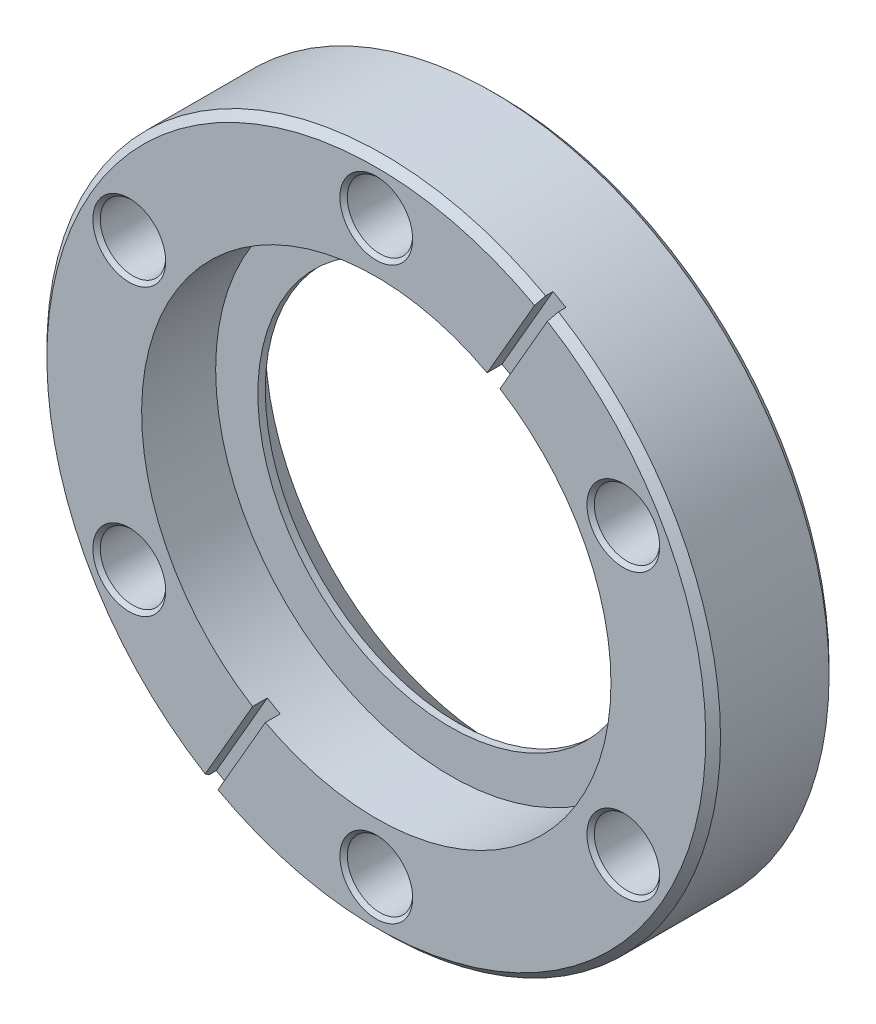
ISO-10303-21;
HEADER;
FILE_DESCRIPTION(('STEP AP214'),'2;1');
FILE_NAME('part.step','',(''),(''),'','','');
FILE_SCHEMA(('AUTOMOTIVE_DESIGN { 1 0 10303 214 1 1 1 1 }'));
ENDSEC;
DATA;
#1=APPLICATION_CONTEXT('core data for automotive mechanical design processes');
#2=APPLICATION_PROTOCOL_DEFINITION('international standard','automotive_design',2000,#1);
#3=PRODUCT_CONTEXT('',#1,'mechanical');
#4=PRODUCT('Part','Part','',(#3));
#5=PRODUCT_RELATED_PRODUCT_CATEGORY('part','',(#4));
#6=PRODUCT_DEFINITION_FORMATION('','',#4);
#7=PRODUCT_DEFINITION_CONTEXT('part definition',#1,'design');
#8=PRODUCT_DEFINITION('design','',#6,#7);
#9=PRODUCT_DEFINITION_SHAPE('','',#8);
#10=(LENGTH_UNIT() NAMED_UNIT(*) SI_UNIT(.MILLI.,.METRE.));
#11=(NAMED_UNIT(*) PLANE_ANGLE_UNIT() SI_UNIT($,.RADIAN.));
#12=(NAMED_UNIT(*) SI_UNIT($,.STERADIAN.) SOLID_ANGLE_UNIT());
#13=UNCERTAINTY_MEASURE_WITH_UNIT(LENGTH_MEASURE(1.E-05),#10,'distance_accuracy_value','');
#14=(GEOMETRIC_REPRESENTATION_CONTEXT(3) GLOBAL_UNCERTAINTY_ASSIGNED_CONTEXT((#13)) GLOBAL_UNIT_ASSIGNED_CONTEXT((#10,
#11,#12)) REPRESENTATION_CONTEXT('',''));
#15=CARTESIAN_POINT('',(0.,0.,0.));
#16=DIRECTION('',(0.,0.,1.));
#17=DIRECTION('',(1.,0.,0.));
#18=AXIS2_PLACEMENT_3D('',#15,#16,#17);
#19=CARTESIAN_POINT('',(-10.8081886423171,-20.2443318662794,-1.524));
#20=DIRECTION('',(0.,0.,1.));
#21=DIRECTION('',(1.,0.,0.));
#22=AXIS2_PLACEMENT_3D('',#19,#20,#21);
#23=PLANE('',#22);
#24=DIRECTION('',(-0.500000000000017,-0.866025403784429,0.));
#25=VECTOR('',#24,1.);
#26=CARTESIAN_POINT('',(0.659911357683662,-0.381,-1.524));
#27=LINE('',#26,#25);
#28=CARTESIAN_POINT('',(-11.411777682795,-21.2897787512802,-1.524));
#29=VERTEX_POINT('',#28);
#30=CARTESIAN_POINT('',(-16.6714013234147,-30.3997141255238,-1.524));
#31=VERTEX_POINT('',#30);
#32=EDGE_CURVE('E111',#29,#31,#27,.T.);
#33=ORIENTED_EDGE('',*,*,#32,.F.);
#34=CARTESIAN_POINT('',(0.,0.,-1.524));
#35=DIRECTION('',(0.,0.,1.));
#36=DIRECTION('',(1.,0.,0.));
#37=AXIS2_PLACEMENT_3D('',#34,#35,#36);
#38=CIRCLE('',#37,24.1554);
#39=CARTESIAN_POINT('',(-12.7316003981625,-20.5277787512802,-1.524));
#40=VERTEX_POINT('',#39);
#41=EDGE_CURVE('E91',#29,#40,#38,.F.);
#42=ORIENTED_EDGE('',*,*,#41,.T.);
#43=DIRECTION('',(-0.500000000000017,-0.866025403784429,0.));
#44=VECTOR('',#43,1.);
#45=CARTESIAN_POINT('',(-0.659911357683662,0.381,-1.524));
#46=LINE('',#45,#44);
#47=CARTESIAN_POINT('',(-17.9912240387821,-29.6377141255239,-1.524));
#48=VERTEX_POINT('',#47);
#49=EDGE_CURVE('E97',#40,#48,#46,.T.);
#50=ORIENTED_EDGE('',*,*,#49,.T.);
#51=CARTESIAN_POINT('',(0.,0.,-1.524));
#52=DIRECTION('',(0.,0.,1.));
#53=DIRECTION('',(1.,0.,0.));
#54=AXIS2_PLACEMENT_3D('',#51,#52,#53);
#55=CIRCLE('',#54,34.671);
#56=EDGE_CURVE('E20',#48,#31,#55,.T.);
#57=ORIENTED_EDGE('',*,*,#56,.T.);
#58=EDGE_LOOP('',(#33,#42,#50,#57));
#59=FACE_BOUND('',#58,.T.);
#60=ADVANCED_FACE('F17',(#59),#23,.T.);
#61=CARTESIAN_POINT('',(12.1280113576829,19.4823318662794,-1.524));
#62=DIRECTION('',(0.,0.,-1.));
#63=DIRECTION('',(-1.,0.,0.));
#64=AXIS2_PLACEMENT_3D('',#61,#62,#63);
#65=PLANE('',#64);
#66=DIRECTION('',(0.500000000000017,0.866025403784429,0.));
#67=VECTOR('',#66,1.);
#68=CARTESIAN_POINT('',(0.659911357683662,-0.381,-1.524));
#69=LINE('',#68,#67);
#70=CARTESIAN_POINT('',(12.7316003981625,20.5277787512802,-1.524));
#71=VERTEX_POINT('',#70);
#72=CARTESIAN_POINT('',(17.9912240387821,29.6377141255239,-1.524));
#73=VERTEX_POINT('',#72);
#74=EDGE_CURVE('E113',#71,#73,#69,.T.);
#75=ORIENTED_EDGE('',*,*,#74,.T.);
#76=CARTESIAN_POINT('',(0.,0.,-1.524));
#77=DIRECTION('',(0.,0.,1.));
#78=DIRECTION('',(1.,0.,0.));
#79=AXIS2_PLACEMENT_3D('',#76,#77,#78);
#80=CIRCLE('',#79,34.671);
#81=CARTESIAN_POINT('',(16.6714013234147,30.3997141255238,-1.524));
#82=VERTEX_POINT('',#81);
#83=EDGE_CURVE('E374',#82,#73,#80,.F.);
#84=ORIENTED_EDGE('',*,*,#83,.F.);
#85=DIRECTION('',(0.500000000000017,0.866025403784429,0.));
#86=VECTOR('',#85,1.);
#87=CARTESIAN_POINT('',(-0.659911357683662,0.381,-1.524));
#88=LINE('',#87,#86);
#89=CARTESIAN_POINT('',(11.411777682795,21.2897787512802,-1.524));
#90=VERTEX_POINT('',#89);
#91=EDGE_CURVE('E102',#90,#82,#88,.T.);
#92=ORIENTED_EDGE('',*,*,#91,.F.);
#93=CARTESIAN_POINT('',(0.,0.,-1.524));
#94=DIRECTION('',(0.,0.,1.));
#95=DIRECTION('',(1.,0.,0.));
#96=AXIS2_PLACEMENT_3D('',#93,#94,#95);
#97=CIRCLE('',#96,24.1554);
#98=EDGE_CURVE('E105',#71,#90,#97,.T.);
#99=ORIENTED_EDGE('',*,*,#98,.F.);
#100=EDGE_LOOP('',(#75,#84,#92,#99));
#101=FACE_BOUND('',#100,.T.);
#102=ADVANCED_FACE('F228',(#101),#65,.F.);
#103=CARTESIAN_POINT('',(-0.659911357683662,0.381,0.));
#104=DIRECTION('',(-0.866025403784429,0.500000000000017,0.));
#105=DIRECTION('',(-0.500000000000017,-0.866025403784429,0.));
#106=AXIS2_PLACEMENT_3D('',#103,#104,#105);
#107=PLANE('',#106);
#108=ORIENTED_EDGE('',*,*,#49,.F.);
#109=DIRECTION('',(0.,0.,1.));
#110=VECTOR('',#109,1.);
#111=CARTESIAN_POINT('',(-12.7316003981627,-20.52777875128,-13.335));
#112=LINE('',#111,#110);
#113=CARTESIAN_POINT('',(-12.731600398163,-20.5277787512798,0.));
#114=VERTEX_POINT('',#113);
#115=EDGE_CURVE('E109',#40,#114,#112,.T.);
#116=ORIENTED_EDGE('',*,*,#115,.T.);
#117=DIRECTION('',(0.499999999999739,0.866025403784589,0.));
#118=VECTOR('',#117,1.);
#119=CARTESIAN_POINT('',(-17.610129918222,-28.9776397462519,0.));
#120=LINE('',#119,#118);
#121=CARTESIAN_POINT('',(-17.6101299182227,-28.9776397462512,-2.81535497978095E-12));
#122=VERTEX_POINT('',#121);
#123=EDGE_CURVE('E189',#122,#114,#120,.T.);
#124=ORIENTED_EDGE('',*,*,#123,.F.);
#125=CARTESIAN_POINT('',(-17.9912240387822,-29.637714125524,-0.761999999999247));
#126=CARTESIAN_POINT('',(-17.9277085263412,-29.5277020309076,-0.634999651275953));
#127=CARTESIAN_POINT('',(-17.8641929267408,-29.4176897853265,-0.507999476914579));
#128=CARTESIAN_POINT('',(-17.7371615532212,-29.1976649922353,-0.253999476915669));
#129=CARTESIAN_POINT('',(-17.673645779302,-29.0876524447252,-0.126999651278132));
#130=CARTESIAN_POINT('',(-17.6101299182234,-28.9776397462504,-2.5153608870471E-12));
#131=B_SPLINE_CURVE_WITH_KNOTS('',3,(#125,#126,#127,#128,#129,#130),.UNSPECIFIED.,.F.,.F.,(4,2,
4),(0.,0.538881924658612,1.07776384931724),.UNSPECIFIED.);
#132=CARTESIAN_POINT('',(-17.9912240387819,-29.6377141255236,-0.761999999999265));
#133=VERTEX_POINT('',#132);
#134=EDGE_CURVE('E101',#133,#122,#131,.T.);
#135=ORIENTED_EDGE('',*,*,#134,.F.);
#136=DIRECTION('',(0.,0.,1.));
#137=VECTOR('',#136,1.);
#138=CARTESIAN_POINT('',(-17.9912240387816,-29.6377141255231,0.));
#139=LINE('',#138,#137);
#140=EDGE_CURVE('E84',#48,#133,#139,.T.);
#141=ORIENTED_EDGE('',*,*,#140,.F.);
#142=EDGE_LOOP('',(#108,#116,#124,#135,#141));
#143=FACE_BOUND('',#142,.T.);
#144=ADVANCED_FACE('F95',(#143),#107,.F.);
#145=CARTESIAN_POINT('',(-0.659911357683662,0.381,0.));
#146=DIRECTION('',(0.866025403784429,-0.500000000000017,0.));
#147=DIRECTION('',(0.500000000000017,0.866025403784429,0.));
#148=AXIS2_PLACEMENT_3D('',#145,#146,#147);
#149=PLANE('',#148);
#150=DIRECTION('',(0.49999999999978,0.866025403784565,0.));
#151=VECTOR('',#150,1.);
#152=CARTESIAN_POINT('',(11.4117776827951,21.2897787512801,0.));
#153=LINE('',#152,#151);
#154=CARTESIAN_POINT('',(11.4117776827951,21.2897787512801,0.));
#155=VERTEX_POINT('',#154);
#156=CARTESIAN_POINT('',(16.2903072028564,29.7396397462523,-1.54719828732884E-12));
#157=VERTEX_POINT('',#156);
#158=EDGE_CURVE('E185',#155,#157,#153,.T.);
#159=ORIENTED_EDGE('',*,*,#158,.F.);
#160=DIRECTION('',(0.,0.,1.));
#161=VECTOR('',#160,1.);
#162=CARTESIAN_POINT('',(11.4117776827951,21.2897787512801,-13.335));
#163=LINE('',#162,#161);
#164=EDGE_CURVE('E196',#155,#90,#163,.F.);
#165=ORIENTED_EDGE('',*,*,#164,.T.);
#166=ORIENTED_EDGE('',*,*,#91,.T.);
#167=DIRECTION('',(0.,0.,1.));
#168=VECTOR('',#167,1.);
#169=CARTESIAN_POINT('',(16.6714013234141,30.3997141255228,0.));
#170=LINE('',#169,#168);
#171=CARTESIAN_POINT('',(16.6714013234151,30.3997141255236,-0.76199999999999));
#172=VERTEX_POINT('',#171);
#173=EDGE_CURVE('E119',#82,#172,#170,.T.);
#174=ORIENTED_EDGE('',*,*,#173,.T.);
#175=DIRECTION('',(0.353597052637596,0.612448060574898,-0.707019446312512));
#176=VECTOR('',#175,1.);
#177=CARTESIAN_POINT('',(16.2903072028577,29.7396397462534,-3.09962559091881E-12));
#178=LINE('',#177,#176);
#179=EDGE_CURVE('E124',#172,#157,#178,.F.);
#180=ORIENTED_EDGE('',*,*,#179,.T.);
#181=EDGE_LOOP('',(#159,#165,#166,#174,#180));
#182=FACE_BOUND('',#181,.T.);
#183=ADVANCED_FACE('F227',(#182),#149,.T.);
#184=CARTESIAN_POINT('',(0.659911357683662,-0.381,0.));
#185=DIRECTION('',(-0.866025403784429,0.500000000000017,0.));
#186=DIRECTION('',(-0.500000000000017,-0.866025403784429,0.));
#187=AXIS2_PLACEMENT_3D('',#184,#185,#186);
#188=PLANE('',#187);
#189=ORIENTED_EDGE('',*,*,#32,.T.);
#190=DIRECTION('',(0.,0.,1.));
#191=VECTOR('',#190,1.);
#192=CARTESIAN_POINT('',(-16.6714013234141,-30.3997141255228,0.));
#193=LINE('',#192,#191);
#194=CARTESIAN_POINT('',(-16.6714013234151,-30.3997141255236,-0.76199999999999));
#195=VERTEX_POINT('',#194);
#196=EDGE_CURVE('E86',#31,#195,#193,.T.);
#197=ORIENTED_EDGE('',*,*,#196,.T.);
#198=DIRECTION('',(-0.353597052637596,-0.612448060574898,-0.707019446312512));
#199=VECTOR('',#198,1.);
#200=CARTESIAN_POINT('',(-16.2903072028577,-29.7396397462534,-3.09962559091881E-12));
#201=LINE('',#200,#199);
#202=CARTESIAN_POINT('',(-16.2903072028565,-29.7396397462523,-1.55669008128939E-12));
#203=VERTEX_POINT('',#202);
#204=EDGE_CURVE('E35',#195,#203,#201,.F.);
#205=ORIENTED_EDGE('',*,*,#204,.T.);
#206=DIRECTION('',(-0.49999999999978,-0.866025403784566,0.));
#207=VECTOR('',#206,1.);
#208=CARTESIAN_POINT('',(-11.4117776827951,-21.2897787512801,0.));
#209=LINE('',#208,#207);
#210=CARTESIAN_POINT('',(-11.4117776827952,-21.2897787512801,0.));
#211=VERTEX_POINT('',#210);
#212=EDGE_CURVE('E184',#211,#203,#209,.T.);
#213=ORIENTED_EDGE('',*,*,#212,.F.);
#214=DIRECTION('',(0.,0.,1.));
#215=VECTOR('',#214,1.);
#216=CARTESIAN_POINT('',(-11.4117776827952,-21.2897787512801,-13.335));
#217=LINE('',#216,#215);
#218=EDGE_CURVE('E349',#211,#29,#217,.F.);
#219=ORIENTED_EDGE('',*,*,#218,.T.);
#220=EDGE_LOOP('',(#189,#197,#205,#213,#219));
#221=FACE_BOUND('',#220,.T.);
#222=ADVANCED_FACE('F375',(#221),#188,.T.);
#223=CARTESIAN_POINT('',(0.659911357683662,-0.381,0.));
#224=DIRECTION('',(0.866025403784429,-0.500000000000017,0.));
#225=DIRECTION('',(0.500000000000017,0.866025403784429,0.));
#226=AXIS2_PLACEMENT_3D('',#223,#224,#225);
#227=PLANE('',#226);
#228=DIRECTION('',(-0.499999999999739,-0.866025403784589,0.));
#229=VECTOR('',#228,1.);
#230=CARTESIAN_POINT('',(17.610129918222,28.9776397462519,0.));
#231=LINE('',#230,#229);
#232=CARTESIAN_POINT('',(17.6101299182227,28.9776397462512,-2.81233144011381E-12));
#233=VERTEX_POINT('',#232);
#234=CARTESIAN_POINT('',(12.731600398163,20.5277787512798,0.));
#235=VERTEX_POINT('',#234);
#236=EDGE_CURVE('E180',#233,#235,#231,.T.);
#237=ORIENTED_EDGE('',*,*,#236,.F.);
#238=CARTESIAN_POINT('',(17.9912240387822,29.637714125524,-0.761999999999247));
#239=CARTESIAN_POINT('',(17.9277085263412,29.5277020309076,-0.634999651275955));
#240=CARTESIAN_POINT('',(17.8641929267408,29.4176897853265,-0.507999476914582));
#241=CARTESIAN_POINT('',(17.7371615532212,29.1976649922353,-0.25399947691567));
#242=CARTESIAN_POINT('',(17.673645779302,29.0876524447252,-0.126999651278131));
#243=CARTESIAN_POINT('',(17.6101299182234,28.9776397462504,-2.51130954748554E-12));
#244=B_SPLINE_CURVE_WITH_KNOTS('',3,(#238,#239,#240,#241,#242,#243),.UNSPECIFIED.,.F.,.F.,(4,2,
4),(0.,0.538881924658614,1.07776384931725),.UNSPECIFIED.);
#245=CARTESIAN_POINT('',(17.9912240387819,29.6377141255236,-0.761999999999265));
#246=VERTEX_POINT('',#245);
#247=EDGE_CURVE('E122',#246,#233,#244,.T.);
#248=ORIENTED_EDGE('',*,*,#247,.F.);
#249=DIRECTION('',(0.,0.,1.));
#250=VECTOR('',#249,1.);
#251=CARTESIAN_POINT('',(17.9912240387816,29.6377141255231,0.));
#252=LINE('',#251,#250);
#253=EDGE_CURVE('E116',#73,#246,#252,.T.);
#254=ORIENTED_EDGE('',*,*,#253,.F.);
#255=ORIENTED_EDGE('',*,*,#74,.F.);
#256=DIRECTION('',(0.,0.,1.));
#257=VECTOR('',#256,1.);
#258=CARTESIAN_POINT('',(12.7316003981627,20.52777875128,-13.335));
#259=LINE('',#258,#257);
#260=EDGE_CURVE('E352',#71,#235,#259,.T.);
#261=ORIENTED_EDGE('',*,*,#260,.T.);
#262=EDGE_LOOP('',(#237,#248,#254,#255,#261));
#263=FACE_BOUND('',#262,.T.);
#264=ADVANCED_FACE('F198',(#263),#227,.F.);
#265=CARTESIAN_POINT('',(0.,0.,-13.335));
#266=DIRECTION('',(0.,0.,1.));
#267=DIRECTION('',(1.,0.,0.));
#268=AXIS2_PLACEMENT_3D('',#265,#266,#267);
#269=CYLINDRICAL_SURFACE('',#268,24.1554);
#270=CARTESIAN_POINT('',(0.,0.,0.));
#271=DIRECTION('',(0.,0.,1.));
#272=DIRECTION('',(1.,0.,0.));
#273=AXIS2_PLACEMENT_3D('',#270,#271,#272);
#274=CIRCLE('',#273,24.1554);
#275=EDGE_CURVE('E181',#235,#211,#274,.F.);
#276=ORIENTED_EDGE('',*,*,#275,.F.);
#277=ORIENTED_EDGE('',*,*,#260,.F.);
#278=ORIENTED_EDGE('',*,*,#98,.T.);
#279=ORIENTED_EDGE('',*,*,#164,.F.);
#280=CARTESIAN_POINT('',(0.,0.,0.));
#281=DIRECTION('',(0.,0.,1.));
#282=DIRECTION('',(1.,0.,0.));
#283=AXIS2_PLACEMENT_3D('',#280,#281,#282);
#284=CIRCLE('',#283,24.1554);
#285=EDGE_CURVE('E186',#114,#155,#284,.F.);
#286=ORIENTED_EDGE('',*,*,#285,.F.);
#287=ORIENTED_EDGE('',*,*,#115,.F.);
#288=ORIENTED_EDGE('',*,*,#41,.F.);
#289=ORIENTED_EDGE('',*,*,#218,.F.);
#290=EDGE_LOOP('',(#276,#277,#278,#279,#286,#287,#288,#289));
#291=FACE_BOUND('',#290,.T.);
#292=CARTESIAN_POINT('',(0.,0.,-7.62));
#293=DIRECTION('',(0.,0.,1.));
#294=DIRECTION('',(1.,0.,0.));
#295=AXIS2_PLACEMENT_3D('',#292,#293,#294);
#296=CIRCLE('',#295,24.1554);
#297=CARTESIAN_POINT('',(24.1554,0.,-7.62));
#298=VERTEX_POINT('',#297);
#299=EDGE_CURVE('E159',#298,#298,#296,.T.);
#300=ORIENTED_EDGE('',*,*,#299,.F.);
#301=EDGE_LOOP('',(#300));
#302=FACE_BOUND('',#301,.T.);
#303=ADVANCED_FACE('F364',(#291,#302),#269,.F.);
#304=CARTESIAN_POINT('',(0.,0.,0.));
#305=DIRECTION('',(0.,0.,1.));
#306=DIRECTION('',(1.,0.,0.));
#307=AXIS2_PLACEMENT_3D('',#304,#305,#306);
#308=PLANE('',#307);
#309=ORIENTED_EDGE('',*,*,#158,.T.);
#310=CARTESIAN_POINT('',(0.,0.,-3.09474668114262E-12));
#311=DIRECTION('',(0.,0.,-1.));
#312=DIRECTION('',(0.,1.,0.));
#313=AXIS2_PLACEMENT_3D('',#310,#311,#312);
#314=CIRCLE('',#313,33.9090000000032);
#315=EDGE_CURVE('E156',#122,#157,#314,.T.);
#316=ORIENTED_EDGE('',*,*,#315,.F.);
#317=ORIENTED_EDGE('',*,*,#123,.T.);
#318=ORIENTED_EDGE('',*,*,#285,.T.);
#319=EDGE_LOOP('',(#309,#316,#317,#318));
#320=FACE_BOUND('',#319,.T.);
#321=CARTESIAN_POINT('',(0.,29.3624,-5.6843418860808E-11));
#322=DIRECTION('',(0.,0.,1.));
#323=DIRECTION('',(1.,0.,0.));
#324=AXIS2_PLACEMENT_3D('',#321,#322,#323);
#325=CIRCLE('',#324,3.746499999977);
#326=CARTESIAN_POINT('',(3.746499999977,29.3624,-5.6843418860808E-11));
#327=VERTEX_POINT('',#326);
#328=EDGE_CURVE('E162',#327,#327,#325,.F.);
#329=ORIENTED_EDGE('',*,*,#328,.T.);
#330=EDGE_LOOP('',(#329));
#331=FACE_BOUND('',#330,.T.);
#332=CARTESIAN_POINT('',(-25.428584316085,-14.6812,5.6843418860808E-11));
#333=DIRECTION('',(0.,0.,1.));
#334=DIRECTION('',(1.,0.,0.));
#335=AXIS2_PLACEMENT_3D('',#332,#333,#334);
#336=CIRCLE('',#335,3.74649999995916);
#337=CARTESIAN_POINT('',(-21.6820843161258,-14.6812,5.6843418860808E-11));
#338=VERTEX_POINT('',#337);
#339=EDGE_CURVE('E174',#338,#338,#336,.F.);
#340=ORIENTED_EDGE('',*,*,#339,.T.);
#341=EDGE_LOOP('',(#340));
#342=FACE_BOUND('',#341,.T.);
#343=CARTESIAN_POINT('',(-25.428584316085,14.6812,5.6843418860808E-11));
#344=DIRECTION('',(0.,0.,1.));
#345=DIRECTION('',(1.,0.,0.));
#346=AXIS2_PLACEMENT_3D('',#343,#344,#345);
#347=CIRCLE('',#346,3.74649999995916);
#348=CARTESIAN_POINT('',(-21.6820843161258,14.6812,5.6843418860808E-11));
#349=VERTEX_POINT('',#348);
#350=EDGE_CURVE('E177',#349,#349,#347,.F.);
#351=ORIENTED_EDGE('',*,*,#350,.T.);
#352=EDGE_LOOP('',(#351));
#353=FACE_BOUND('',#352,.T.);
#354=ADVANCED_FACE('F370',(#320,#331,#342,#353),#308,.T.);
#355=CARTESIAN_POINT('',(0.,0.,0.));
#356=DIRECTION('',(0.,0.,1.));
#357=DIRECTION('',(1.,0.,0.));
#358=AXIS2_PLACEMENT_3D('',#355,#356,#357);
#359=PLANE('',#358);
#360=CARTESIAN_POINT('',(0.,0.,-3.11361179894387E-12));
#361=DIRECTION('',(0.,0.,-1.));
#362=DIRECTION('',(-1.,0.,0.));
#363=AXIS2_PLACEMENT_3D('',#360,#361,#362);
#364=CIRCLE('',#363,33.9090000000032);
#365=EDGE_CURVE('E152',#233,#203,#364,.T.);
#366=ORIENTED_EDGE('',*,*,#365,.F.);
#367=ORIENTED_EDGE('',*,*,#236,.T.);
#368=ORIENTED_EDGE('',*,*,#275,.T.);
#369=ORIENTED_EDGE('',*,*,#212,.T.);
#370=EDGE_LOOP('',(#366,#367,#368,#369));
#371=FACE_BOUND('',#370,.T.);
#372=CARTESIAN_POINT('',(25.428584316085,14.6812,0.));
#373=DIRECTION('',(0.,0.,1.));
#374=DIRECTION('',(1.,0.,0.));
#375=AXIS2_PLACEMENT_3D('',#372,#373,#374);
#376=CIRCLE('',#375,3.74650000010853);
#377=CARTESIAN_POINT('',(29.1750843161935,14.6812,0.));
#378=VERTEX_POINT('',#377);
#379=EDGE_CURVE('E165',#378,#378,#376,.F.);
#380=ORIENTED_EDGE('',*,*,#379,.T.);
#381=EDGE_LOOP('',(#380));
#382=FACE_BOUND('',#381,.T.);
#383=CARTESIAN_POINT('',(25.428584316085,-14.6812,0.));
#384=DIRECTION('',(0.,0.,1.));
#385=DIRECTION('',(1.,0.,0.));
#386=AXIS2_PLACEMENT_3D('',#383,#384,#385);
#387=CIRCLE('',#386,3.74650000010853);
#388=CARTESIAN_POINT('',(29.1750843161935,-14.6812,0.));
#389=VERTEX_POINT('',#388);
#390=EDGE_CURVE('E168',#389,#389,#387,.F.);
#391=ORIENTED_EDGE('',*,*,#390,.T.);
#392=EDGE_LOOP('',(#391));
#393=FACE_BOUND('',#392,.T.);
#394=CARTESIAN_POINT('',(0.,-29.3624,-5.6843418860808E-11));
#395=DIRECTION('',(0.,0.,1.));
#396=DIRECTION('',(1.,0.,0.));
#397=AXIS2_PLACEMENT_3D('',#394,#395,#396);
#398=CIRCLE('',#397,3.746499999977);
#399=CARTESIAN_POINT('',(3.746499999977,-29.3624,-5.6843418860808E-11));
#400=VERTEX_POINT('',#399);
#401=EDGE_CURVE('E171',#400,#400,#398,.F.);
#402=ORIENTED_EDGE('',*,*,#401,.T.);
#403=EDGE_LOOP('',(#402));
#404=FACE_BOUND('',#403,.T.);
#405=ADVANCED_FACE('F379',(#371,#382,#393,#404),#359,.T.);
#406=CARTESIAN_POINT('',(-25.428584316085,14.6812,5.6843418860808E-11));
#407=DIRECTION('',(0.,0.,1.));
#408=DIRECTION('',(1.,0.,0.));
#409=AXIS2_PLACEMENT_3D('',#406,#407,#408);
#410=CONICAL_SURFACE('',#409,3.74649999995916,0.785398163397448);
#411=CARTESIAN_POINT('',(-25.428584316085,14.6812,-0.381));
#412=DIRECTION('',(0.,0.,-1.));
#413=DIRECTION('',(-1.,0.,0.));
#414=AXIS2_PLACEMENT_3D('',#411,#412,#413);
#415=CIRCLE('',#414,3.3655);
#416=CARTESIAN_POINT('',(-28.794084316085,14.6812,-0.381));
#417=VERTEX_POINT('',#416);
#418=EDGE_CURVE('E155',#417,#417,#415,.T.);
#419=ORIENTED_EDGE('',*,*,#418,.T.);
#420=EDGE_LOOP('',(#419));
#421=FACE_BOUND('',#420,.T.);
#422=ORIENTED_EDGE('',*,*,#350,.F.);
#423=EDGE_LOOP('',(#422));
#424=FACE_BOUND('',#423,.T.);
#425=ADVANCED_FACE('F436',(#421,#424),#410,.F.);
#426=CARTESIAN_POINT('',(-25.428584316085,-14.6812,5.6843418860808E-11));
#427=DIRECTION('',(0.,0.,1.));
#428=DIRECTION('',(1.,0.,0.));
#429=AXIS2_PLACEMENT_3D('',#426,#427,#428);
#430=CONICAL_SURFACE('',#429,3.74649999995916,0.785398163397448);
#431=CARTESIAN_POINT('',(-25.428584316085,-14.6812,-0.381));
#432=DIRECTION('',(0.,0.,-1.));
#433=DIRECTION('',(-1.,0.,0.));
#434=AXIS2_PLACEMENT_3D('',#431,#432,#433);
#435=CIRCLE('',#434,3.3655);
#436=CARTESIAN_POINT('',(-28.794084316085,-14.6812,-0.381));
#437=VERTEX_POINT('',#436);
#438=EDGE_CURVE('E307',#437,#437,#435,.T.);
#439=ORIENTED_EDGE('',*,*,#438,.T.);
#440=EDGE_LOOP('',(#439));
#441=FACE_BOUND('',#440,.T.);
#442=ORIENTED_EDGE('',*,*,#339,.F.);
#443=EDGE_LOOP('',(#442));
#444=FACE_BOUND('',#443,.T.);
#445=ADVANCED_FACE('F443',(#441,#444),#430,.F.);
#446=CARTESIAN_POINT('',(0.,-29.3624,-5.6843418860808E-11));
#447=DIRECTION('',(0.,0.,1.));
#448=DIRECTION('',(1.,0.,0.));
#449=AXIS2_PLACEMENT_3D('',#446,#447,#448);
#450=CONICAL_SURFACE('',#449,3.746499999977,0.785398163472046);
#451=CARTESIAN_POINT('',(0.,-29.3624,-0.381));
#452=DIRECTION('',(0.,0.,-1.));
#453=DIRECTION('',(-1.,0.,0.));
#454=AXIS2_PLACEMENT_3D('',#451,#452,#453);
#455=CIRCLE('',#454,3.3655);
#456=CARTESIAN_POINT('',(-3.3655,-29.3624,-0.381));
#457=VERTEX_POINT('',#456);
#458=EDGE_CURVE('E333',#457,#457,#455,.T.);
#459=ORIENTED_EDGE('',*,*,#458,.T.);
#460=EDGE_LOOP('',(#459));
#461=FACE_BOUND('',#460,.T.);
#462=ORIENTED_EDGE('',*,*,#401,.F.);
#463=EDGE_LOOP('',(#462));
#464=FACE_BOUND('',#463,.T.);
#465=ADVANCED_FACE('F451',(#461,#464),#450,.F.);
#466=CARTESIAN_POINT('',(25.428584316085,-14.6812,0.));
#467=DIRECTION('',(0.,0.,1.));
#468=DIRECTION('',(1.,0.,0.));
#469=AXIS2_PLACEMENT_3D('',#466,#467,#468);
#470=CONICAL_SURFACE('',#469,3.74650000010853,0.785398163397448);
#471=CARTESIAN_POINT('',(25.428584316085,-14.6812,-0.381));
#472=DIRECTION('',(0.,0.,-1.));
#473=DIRECTION('',(-1.,0.,0.));
#474=AXIS2_PLACEMENT_3D('',#471,#472,#473);
#475=CIRCLE('',#474,3.3655);
#476=CARTESIAN_POINT('',(22.063084316085,-14.6812,-0.381));
#477=VERTEX_POINT('',#476);
#478=EDGE_CURVE('E330',#477,#477,#475,.T.);
#479=ORIENTED_EDGE('',*,*,#478,.T.);
#480=EDGE_LOOP('',(#479));
#481=FACE_BOUND('',#480,.T.);
#482=ORIENTED_EDGE('',*,*,#390,.F.);
#483=EDGE_LOOP('',(#482));
#484=FACE_BOUND('',#483,.T.);
#485=ADVANCED_FACE('F459',(#481,#484),#470,.F.);
#486=CARTESIAN_POINT('',(25.428584316085,14.6812,0.));
#487=DIRECTION('',(0.,0.,1.));
#488=DIRECTION('',(1.,0.,0.));
#489=AXIS2_PLACEMENT_3D('',#486,#487,#488);
#490=CONICAL_SURFACE('',#489,3.74650000010853,0.785398163397448);
#491=CARTESIAN_POINT('',(25.428584316085,14.6812,-0.381));
#492=DIRECTION('',(0.,0.,-1.));
#493=DIRECTION('',(-1.,0.,0.));
#494=AXIS2_PLACEMENT_3D('',#491,#492,#493);
#495=CIRCLE('',#494,3.3655);
#496=CARTESIAN_POINT('',(22.063084316085,14.6812,-0.381));
#497=VERTEX_POINT('',#496);
#498=EDGE_CURVE('E327',#497,#497,#495,.T.);
#499=ORIENTED_EDGE('',*,*,#498,.T.);
#500=EDGE_LOOP('',(#499));
#501=FACE_BOUND('',#500,.T.);
#502=ORIENTED_EDGE('',*,*,#379,.F.);
#503=EDGE_LOOP('',(#502));
#504=FACE_BOUND('',#503,.T.);
#505=ADVANCED_FACE('F467',(#501,#504),#490,.F.);
#506=CARTESIAN_POINT('',(0.,29.3624,-5.6843418860808E-11));
#507=DIRECTION('',(0.,0.,1.));
#508=DIRECTION('',(1.,0.,0.));
#509=AXIS2_PLACEMENT_3D('',#506,#507,#508);
#510=CONICAL_SURFACE('',#509,3.746499999977,0.785398163472046);
#511=CARTESIAN_POINT('',(0.,29.3624,-0.381));
#512=DIRECTION('',(0.,0.,-1.));
#513=DIRECTION('',(-1.,0.,0.));
#514=AXIS2_PLACEMENT_3D('',#511,#512,#513);
#515=CIRCLE('',#514,3.3655);
#516=CARTESIAN_POINT('',(-3.3655,29.3624,-0.381));
#517=VERTEX_POINT('',#516);
#518=EDGE_CURVE('E151',#517,#517,#515,.T.);
#519=ORIENTED_EDGE('',*,*,#518,.T.);
#520=EDGE_LOOP('',(#519));
#521=FACE_BOUND('',#520,.T.);
#522=ORIENTED_EDGE('',*,*,#328,.F.);
#523=EDGE_LOOP('',(#522));
#524=FACE_BOUND('',#523,.T.);
#525=ADVANCED_FACE('F475',(#521,#524),#510,.F.);
#526=CARTESIAN_POINT('',(0.,0.,-7.62));
#527=DIRECTION('',(0.,0.,1.));
#528=DIRECTION('',(1.,0.,0.));
#529=AXIS2_PLACEMENT_3D('',#526,#527,#528);
#530=PLANE('',#529);
#531=ORIENTED_EDGE('',*,*,#299,.T.);
#532=EDGE_LOOP('',(#531));
#533=FACE_BOUND('',#532,.T.);
#534=CARTESIAN_POINT('',(0.,0.,-7.62));
#535=DIRECTION('',(0.,0.,1.));
#536=DIRECTION('',(1.,0.,0.));
#537=AXIS2_PLACEMENT_3D('',#534,#535,#536);
#538=CIRCLE('',#537,19.812);
#539=CARTESIAN_POINT('',(19.812,0.,-7.62));
#540=VERTEX_POINT('',#539);
#541=EDGE_CURVE('E147',#540,#540,#538,.F.);
#542=ORIENTED_EDGE('',*,*,#541,.T.);
#543=EDGE_LOOP('',(#542));
#544=FACE_BOUND('',#543,.T.);
#545=ADVANCED_FACE('F213',(#533,#544),#530,.T.);
#546=CARTESIAN_POINT('',(0.,0.,-0.761999999998954));
#547=DIRECTION('',(0.,0.,-1.));
#548=DIRECTION('',(0.,1.,0.));
#549=AXIS2_PLACEMENT_3D('',#546,#547,#548);
#550=CONICAL_SURFACE('',#549,34.6709999999988,0.785398163397301);
#551=ORIENTED_EDGE('',*,*,#179,.F.);
#552=CARTESIAN_POINT('',(0.,0.,-0.762));
#553=DIRECTION('',(0.,0.,1.));
#554=DIRECTION('',(1.,0.,0.));
#555=AXIS2_PLACEMENT_3D('',#552,#553,#554);
#556=CIRCLE('',#555,34.671);
#557=EDGE_CURVE('E150',#133,#172,#556,.F.);
#558=ORIENTED_EDGE('',*,*,#557,.F.);
#559=ORIENTED_EDGE('',*,*,#134,.T.);
#560=ORIENTED_EDGE('',*,*,#315,.T.);
#561=EDGE_LOOP('',(#551,#558,#559,#560));
#562=FACE_BOUND('',#561,.T.);
#563=ADVANCED_FACE('F208',(#562),#550,.T.);
#564=CARTESIAN_POINT('',(0.,0.,-0.762000000000056));
#565=DIRECTION('',(0.,0.,-1.));
#566=DIRECTION('',(-1.,0.,0.));
#567=AXIS2_PLACEMENT_3D('',#564,#565,#566);
#568=CONICAL_SURFACE('',#567,34.6709999999999,0.785398163397301);
#569=CARTESIAN_POINT('',(0.,0.,-0.761999999999283));
#570=DIRECTION('',(0.,0.,1.));
#571=DIRECTION('',(1.,0.,0.));
#572=AXIS2_PLACEMENT_3D('',#569,#570,#571);
#573=CIRCLE('',#572,34.671);
#574=EDGE_CURVE('E318',#246,#195,#573,.F.);
#575=ORIENTED_EDGE('',*,*,#574,.F.);
#576=ORIENTED_EDGE('',*,*,#247,.T.);
#577=ORIENTED_EDGE('',*,*,#365,.T.);
#578=ORIENTED_EDGE('',*,*,#204,.F.);
#579=EDGE_LOOP('',(#575,#576,#577,#578));
#580=FACE_BOUND('',#579,.T.);
#581=ADVANCED_FACE('F202',(#580),#568,.T.);
#582=CARTESIAN_POINT('',(-25.428584316085,14.6812,0.));
#583=DIRECTION('',(0.,0.,-1.));
#584=DIRECTION('',(-1.,0.,0.));
#585=AXIS2_PLACEMENT_3D('',#582,#583,#584);
#586=CYLINDRICAL_SURFACE('',#585,3.3655);
#587=ORIENTED_EDGE('',*,*,#418,.F.);
#588=EDGE_LOOP('',(#587));
#589=FACE_BOUND('',#588,.T.);
#590=CARTESIAN_POINT('',(-25.428584316085,14.6812,-12.3189999998772));
#591=DIRECTION('',(0.,0.,-1.));
#592=DIRECTION('',(-1.,0.,0.));
#593=AXIS2_PLACEMENT_3D('',#590,#591,#592);
#594=CIRCLE('',#593,3.3654999999336);
#595=CARTESIAN_POINT('',(-28.7940843160186,14.6812,-12.3189999998772));
#596=VERTEX_POINT('',#595);
#597=EDGE_CURVE('E312',#596,#596,#594,.T.);
#598=ORIENTED_EDGE('',*,*,#597,.T.);
#599=EDGE_LOOP('',(#598));
#600=FACE_BOUND('',#599,.T.);
#601=ADVANCED_FACE('F207',(#589,#600),#586,.F.);
#602=CARTESIAN_POINT('',(-25.428584316085,-14.6812,0.));
#603=DIRECTION('',(0.,0.,-1.));
#604=DIRECTION('',(-1.,0.,0.));
#605=AXIS2_PLACEMENT_3D('',#602,#603,#604);
#606=CYLINDRICAL_SURFACE('',#605,3.3655);
#607=ORIENTED_EDGE('',*,*,#438,.F.);
#608=EDGE_LOOP('',(#607));
#609=FACE_BOUND('',#608,.T.);
#610=CARTESIAN_POINT('',(-25.428584316085,-14.6812,-12.3189999998772));
#611=DIRECTION('',(0.,0.,-1.));
#612=DIRECTION('',(-1.,0.,0.));
#613=AXIS2_PLACEMENT_3D('',#610,#611,#612);
#614=CIRCLE('',#613,3.3654999999336);
#615=CARTESIAN_POINT('',(-28.7940843160186,-14.6812,-12.3189999998772));
#616=VERTEX_POINT('',#615);
#617=EDGE_CURVE('E310',#616,#616,#614,.T.);
#618=ORIENTED_EDGE('',*,*,#617,.T.);
#619=EDGE_LOOP('',(#618));
#620=FACE_BOUND('',#619,.T.);
#621=ADVANCED_FACE('F296',(#609,#620),#606,.F.);
#622=CARTESIAN_POINT('',(0.,-29.3624,0.));
#623=DIRECTION('',(0.,0.,-1.));
#624=DIRECTION('',(-1.,0.,0.));
#625=AXIS2_PLACEMENT_3D('',#622,#623,#624);
#626=CYLINDRICAL_SURFACE('',#625,3.3655);
#627=ORIENTED_EDGE('',*,*,#458,.F.);
#628=EDGE_LOOP('',(#627));
#629=FACE_BOUND('',#628,.T.);
#630=CARTESIAN_POINT('',(0.,-29.3624,-12.3190000000477));
#631=DIRECTION('',(0.,0.,-1.));
#632=DIRECTION('',(-1.,0.,0.));
#633=AXIS2_PLACEMENT_3D('',#630,#631,#632);
#634=CIRCLE('',#633,3.36550000002944);
#635=CARTESIAN_POINT('',(-3.36550000002944,-29.3624,-12.3190000000477));
#636=VERTEX_POINT('',#635);
#637=EDGE_CURVE('E311',#636,#636,#634,.T.);
#638=ORIENTED_EDGE('',*,*,#637,.T.);
#639=EDGE_LOOP('',(#638));
#640=FACE_BOUND('',#639,.T.);
#641=ADVANCED_FACE('F293',(#629,#640),#626,.F.);
#642=CARTESIAN_POINT('',(25.428584316085,-14.6812,0.));
#643=DIRECTION('',(0.,0.,-1.));
#644=DIRECTION('',(-1.,0.,0.));
#645=AXIS2_PLACEMENT_3D('',#642,#643,#644);
#646=CYLINDRICAL_SURFACE('',#645,3.3655);
#647=ORIENTED_EDGE('',*,*,#478,.F.);
#648=EDGE_LOOP('',(#647));
#649=FACE_BOUND('',#648,.T.);
#650=CARTESIAN_POINT('',(25.428584316085,-14.6812,-12.3190000000477));
#651=DIRECTION('',(0.,0.,-1.));
#652=DIRECTION('',(-1.,0.,0.));
#653=AXIS2_PLACEMENT_3D('',#650,#651,#652);
#654=CIRCLE('',#653,3.3655000000116);
#655=CARTESIAN_POINT('',(22.0630843160734,-14.6812,-12.3190000000477));
#656=VERTEX_POINT('',#655);
#657=EDGE_CURVE('E315',#656,#656,#654,.T.);
#658=ORIENTED_EDGE('',*,*,#657,.T.);
#659=EDGE_LOOP('',(#658));
#660=FACE_BOUND('',#659,.T.);
#661=ADVANCED_FACE('F289',(#649,#660),#646,.F.);
#662=CARTESIAN_POINT('',(25.428584316085,14.6812,0.));
#663=DIRECTION('',(0.,0.,-1.));
#664=DIRECTION('',(-1.,0.,0.));
#665=AXIS2_PLACEMENT_3D('',#662,#663,#664);
#666=CYLINDRICAL_SURFACE('',#665,3.3655);
#667=ORIENTED_EDGE('',*,*,#498,.F.);
#668=EDGE_LOOP('',(#667));
#669=FACE_BOUND('',#668,.T.);
#670=CARTESIAN_POINT('',(25.428584316085,14.6812,-12.3190000000477));
#671=DIRECTION('',(0.,0.,-1.));
#672=DIRECTION('',(-1.,0.,0.));
#673=AXIS2_PLACEMENT_3D('',#670,#671,#672);
#674=CIRCLE('',#673,3.3655000000116);
#675=CARTESIAN_POINT('',(22.0630843160734,14.6812,-12.3190000000477));
#676=VERTEX_POINT('',#675);
#677=EDGE_CURVE('E580',#676,#676,#674,.T.);
#678=ORIENTED_EDGE('',*,*,#677,.T.);
#679=EDGE_LOOP('',(#678));
#680=FACE_BOUND('',#679,.T.);
#681=ADVANCED_FACE('F285',(#669,#680),#666,.F.);
#682=CARTESIAN_POINT('',(0.,29.3624,0.));
#683=DIRECTION('',(0.,0.,-1.));
#684=DIRECTION('',(-1.,0.,0.));
#685=AXIS2_PLACEMENT_3D('',#682,#683,#684);
#686=CYLINDRICAL_SURFACE('',#685,3.3655);
#687=ORIENTED_EDGE('',*,*,#518,.F.);
#688=EDGE_LOOP('',(#687));
#689=FACE_BOUND('',#688,.T.);
#690=CARTESIAN_POINT('',(0.,29.3624,-12.3190000000477));
#691=DIRECTION('',(0.,0.,-1.));
#692=DIRECTION('',(-1.,0.,0.));
#693=AXIS2_PLACEMENT_3D('',#690,#691,#692);
#694=CIRCLE('',#693,3.36550000002944);
#695=CARTESIAN_POINT('',(-3.36550000002944,29.3624,-12.3190000000477));
#696=VERTEX_POINT('',#695);
#697=EDGE_CURVE('E578',#696,#696,#694,.T.);
#698=ORIENTED_EDGE('',*,*,#697,.T.);
#699=EDGE_LOOP('',(#698));
#700=FACE_BOUND('',#699,.T.);
#701=ADVANCED_FACE('F281',(#689,#700),#686,.F.);
#702=CARTESIAN_POINT('',(0.,0.,-13.335));
#703=DIRECTION('',(0.,0.,1.));
#704=DIRECTION('',(1.,0.,0.));
#705=AXIS2_PLACEMENT_3D('',#702,#703,#704);
#706=CYLINDRICAL_SURFACE('',#705,19.812);
#707=CARTESIAN_POINT('',(0.,0.,-8.38199999999968));
#708=DIRECTION('',(0.,0.,-1.));
#709=DIRECTION('',(-1.,0.,0.));
#710=AXIS2_PLACEMENT_3D('',#707,#708,#709);
#711=CIRCLE('',#710,19.8120000000003);
#712=CARTESIAN_POINT('',(-19.8120000000003,0.,-8.38199999999968));
#713=VERTEX_POINT('',#712);
#714=EDGE_CURVE('E579',#713,#713,#711,.T.);
#715=ORIENTED_EDGE('',*,*,#714,.T.);
#716=EDGE_LOOP('',(#715));
#717=FACE_BOUND('',#716,.T.);
#718=ORIENTED_EDGE('',*,*,#541,.F.);
#719=EDGE_LOOP('',(#718));
#720=FACE_BOUND('',#719,.T.);
#721=ADVANCED_FACE('F278',(#717,#720),#706,.F.);
#722=CARTESIAN_POINT('',(0.,0.,0.));
#723=DIRECTION('',(0.,0.,1.));
#724=DIRECTION('',(1.,0.,0.));
#725=AXIS2_PLACEMENT_3D('',#722,#723,#724);
#726=CYLINDRICAL_SURFACE('',#725,34.671);
#727=ORIENTED_EDGE('',*,*,#140,.T.);
#728=ORIENTED_EDGE('',*,*,#557,.T.);
#729=ORIENTED_EDGE('',*,*,#173,.F.);
#730=ORIENTED_EDGE('',*,*,#83,.T.);
#731=ORIENTED_EDGE('',*,*,#253,.T.);
#732=ORIENTED_EDGE('',*,*,#574,.T.);
#733=ORIENTED_EDGE('',*,*,#196,.F.);
#734=ORIENTED_EDGE('',*,*,#56,.F.);
#735=EDGE_LOOP('',(#727,#728,#729,#730,#731,#732,#733,#734));
#736=FACE_BOUND('',#735,.T.);
#737=CARTESIAN_POINT('',(0.,0.,-11.9379999999999));
#738=DIRECTION('',(0.,0.,1.));
#739=DIRECTION('',(1.,0.,0.));
#740=AXIS2_PLACEMENT_3D('',#737,#738,#739);
#741=CIRCLE('',#740,34.6709999999999);
#742=CARTESIAN_POINT('',(34.6709999999999,0.,-11.9379999999999));
#743=VERTEX_POINT('',#742);
#744=EDGE_CURVE('E146',#743,#743,#741,.F.);
#745=ORIENTED_EDGE('',*,*,#744,.F.);
#746=EDGE_LOOP('',(#745));
#747=FACE_BOUND('',#746,.T.);
#748=ADVANCED_FACE('F81',(#736,#747),#726,.T.);
#749=CARTESIAN_POINT('',(-25.428584316085,14.6812,-12.6999999998816));
#750=DIRECTION('',(0.,0.,-1.));
#751=DIRECTION('',(-1.,0.,0.));
#752=AXIS2_PLACEMENT_3D('',#749,#750,#751);
#753=CONICAL_SURFACE('',#752,3.746499999938,0.785398163397448);
#754=ORIENTED_EDGE('',*,*,#597,.F.);
#755=EDGE_LOOP('',(#754));
#756=FACE_BOUND('',#755,.T.);
#757=CARTESIAN_POINT('',(-25.428584316085,14.6812,-12.6999999999384));
#758=DIRECTION('',(0.,0.,-1.));
#759=DIRECTION('',(-1.,0.,0.));
#760=AXIS2_PLACEMENT_3D('',#757,#758,#759);
#761=CIRCLE('',#760,3.74649999999485);
#762=CARTESIAN_POINT('',(-29.1750843160798,14.6812,-12.6999999999384));
#763=VERTEX_POINT('',#762);
#764=EDGE_CURVE('E143',#763,#763,#761,.T.);
#765=ORIENTED_EDGE('',*,*,#764,.T.);
#766=EDGE_LOOP('',(#765));
#767=FACE_BOUND('',#766,.T.);
#768=ADVANCED_FACE('F271',(#756,#767),#753,.F.);
#769=CARTESIAN_POINT('',(-25.428584316085,-14.6812,-12.6999999998816));
#770=DIRECTION('',(0.,0.,-1.));
#771=DIRECTION('',(-1.,0.,0.));
#772=AXIS2_PLACEMENT_3D('',#769,#770,#771);
#773=CONICAL_SURFACE('',#772,3.746499999938,0.785398163397448);
#774=ORIENTED_EDGE('',*,*,#617,.F.);
#775=EDGE_LOOP('',(#774));
#776=FACE_BOUND('',#775,.T.);
#777=CARTESIAN_POINT('',(-25.428584316085,-14.6812,-12.6999999999384));
#778=DIRECTION('',(0.,0.,-1.));
#779=DIRECTION('',(-1.,0.,0.));
#780=AXIS2_PLACEMENT_3D('',#777,#778,#779);
#781=CIRCLE('',#780,3.74649999999485);
#782=CARTESIAN_POINT('',(-29.1750843160798,-14.6812,-12.6999999999384));
#783=VERTEX_POINT('',#782);
#784=EDGE_CURVE('E140',#783,#783,#781,.T.);
#785=ORIENTED_EDGE('',*,*,#784,.T.);
#786=EDGE_LOOP('',(#785));
#787=FACE_BOUND('',#786,.T.);
#788=ADVANCED_FACE('F267',(#776,#787),#773,.F.);
#789=CARTESIAN_POINT('',(0.,-29.3624,-12.6999999998816));
#790=DIRECTION('',(0.,0.,-1.));
#791=DIRECTION('',(-1.,0.,0.));
#792=AXIS2_PLACEMENT_3D('',#789,#790,#791);
#793=CONICAL_SURFACE('',#792,3.746499999977,0.785398163472046);
#794=ORIENTED_EDGE('',*,*,#637,.F.);
#795=EDGE_LOOP('',(#794));
#796=FACE_BOUND('',#795,.T.);
#797=CARTESIAN_POINT('',(0.,-29.3624,-12.6999999999384));
#798=DIRECTION('',(0.,0.,-1.));
#799=DIRECTION('',(-1.,0.,0.));
#800=AXIS2_PLACEMENT_3D('',#797,#798,#799);
#801=CIRCLE('',#800,3.74650000003385);
#802=CARTESIAN_POINT('',(-3.74650000003385,-29.3624,-12.6999999999384));
#803=VERTEX_POINT('',#802);
#804=EDGE_CURVE('E137',#803,#803,#801,.T.);
#805=ORIENTED_EDGE('',*,*,#804,.T.);
#806=EDGE_LOOP('',(#805));
#807=FACE_BOUND('',#806,.T.);
#808=ADVANCED_FACE('F263',(#796,#807),#793,.F.);
#809=CARTESIAN_POINT('',(25.428584316085,-14.6812,-12.6999999999953));
#810=DIRECTION('',(0.,0.,-1.));
#811=DIRECTION('',(-1.,0.,0.));
#812=AXIS2_PLACEMENT_3D('',#809,#810,#811);
#813=CONICAL_SURFACE('',#812,3.746500000016,0.785398163472046);
#814=ORIENTED_EDGE('',*,*,#657,.F.);
#815=EDGE_LOOP('',(#814));
#816=FACE_BOUND('',#815,.T.);
#817=CARTESIAN_POINT('',(25.428584316085,-14.6812,-12.7000000000131));
#818=DIRECTION('',(0.,0.,-1.));
#819=DIRECTION('',(-1.,0.,0.));
#820=AXIS2_PLACEMENT_3D('',#817,#818,#819);
#821=CIRCLE('',#820,3.74650000003385);
#822=CARTESIAN_POINT('',(21.6820843160512,-14.6812,-12.7000000000131));
#823=VERTEX_POINT('',#822);
#824=EDGE_CURVE('E134',#823,#823,#821,.T.);
#825=ORIENTED_EDGE('',*,*,#824,.T.);
#826=EDGE_LOOP('',(#825));
#827=FACE_BOUND('',#826,.T.);
#828=ADVANCED_FACE('F259',(#816,#827),#813,.F.);
#829=CARTESIAN_POINT('',(25.428584316085,14.6812,-12.6999999999953));
#830=DIRECTION('',(0.,0.,-1.));
#831=DIRECTION('',(-1.,0.,0.));
#832=AXIS2_PLACEMENT_3D('',#829,#830,#831);
#833=CONICAL_SURFACE('',#832,3.746500000016,0.785398163472046);
#834=ORIENTED_EDGE('',*,*,#677,.F.);
#835=EDGE_LOOP('',(#834));
#836=FACE_BOUND('',#835,.T.);
#837=CARTESIAN_POINT('',(25.428584316085,14.6812,-12.7000000000131));
#838=DIRECTION('',(0.,0.,-1.));
#839=DIRECTION('',(-1.,0.,0.));
#840=AXIS2_PLACEMENT_3D('',#837,#838,#839);
#841=CIRCLE('',#840,3.74650000003385);
#842=CARTESIAN_POINT('',(21.6820843160512,14.6812,-12.7000000000131));
#843=VERTEX_POINT('',#842);
#844=EDGE_CURVE('E131',#843,#843,#841,.T.);
#845=ORIENTED_EDGE('',*,*,#844,.T.);
#846=EDGE_LOOP('',(#845));
#847=FACE_BOUND('',#846,.T.);
#848=ADVANCED_FACE('F255',(#836,#847),#833,.F.);
#849=CARTESIAN_POINT('',(0.,29.3624,-12.6999999998816));
#850=DIRECTION('',(0.,0.,-1.));
#851=DIRECTION('',(-1.,0.,0.));
#852=AXIS2_PLACEMENT_3D('',#849,#850,#851);
#853=CONICAL_SURFACE('',#852,3.746499999977,0.785398163472046);
#854=ORIENTED_EDGE('',*,*,#697,.F.);
#855=EDGE_LOOP('',(#854));
#856=FACE_BOUND('',#855,.T.);
#857=CARTESIAN_POINT('',(0.,29.3624,-12.6999999999384));
#858=DIRECTION('',(0.,0.,-1.));
#859=DIRECTION('',(-1.,0.,0.));
#860=AXIS2_PLACEMENT_3D('',#857,#858,#859);
#861=CIRCLE('',#860,3.74650000003385);
#862=CARTESIAN_POINT('',(-3.74650000003385,29.3624,-12.6999999999384));
#863=VERTEX_POINT('',#862);
#864=EDGE_CURVE('E128',#863,#863,#861,.T.);
#865=ORIENTED_EDGE('',*,*,#864,.T.);
#866=EDGE_LOOP('',(#865));
#867=FACE_BOUND('',#866,.T.);
#868=ADVANCED_FACE('F251',(#856,#867),#853,.F.);
#869=CARTESIAN_POINT('',(0.,0.,-12.7000000000003));
#870=DIRECTION('',(0.,0.,-1.));
#871=DIRECTION('',(0.,1.,0.));
#872=AXIS2_PLACEMENT_3D('',#869,#870,#871);
#873=CONICAL_SURFACE('',#872,24.1299999999997,0.7853981633973);
#874=ORIENTED_EDGE('',*,*,#714,.F.);
#875=EDGE_LOOP('',(#874));
#876=FACE_BOUND('',#875,.T.);
#877=CARTESIAN_POINT('',(0.,0.,-12.7000000000003));
#878=DIRECTION('',(0.,0.,-1.));
#879=DIRECTION('',(0.,1.,0.));
#880=AXIS2_PLACEMENT_3D('',#877,#878,#879);
#881=CIRCLE('',#880,24.1299999999997);
#882=CARTESIAN_POINT('',(0.,24.1299999999997,-12.7000000000003));
#883=VERTEX_POINT('',#882);
#884=EDGE_CURVE('E26',#883,#883,#881,.T.);
#885=ORIENTED_EDGE('',*,*,#884,.T.);
#886=EDGE_LOOP('',(#885));
#887=FACE_BOUND('',#886,.T.);
#888=ADVANCED_FACE('F243',(#876,#887),#873,.F.);
#889=CARTESIAN_POINT('',(0.,0.,-11.9379999999999));
#890=DIRECTION('',(0.,0.,1.));
#891=DIRECTION('',(1.,0.,0.));
#892=AXIS2_PLACEMENT_3D('',#889,#890,#891);
#893=CONICAL_SURFACE('',#892,34.6709999999999,0.7853981633973);
#894=ORIENTED_EDGE('',*,*,#744,.T.);
#895=EDGE_LOOP('',(#894));
#896=FACE_BOUND('',#895,.T.);
#897=CARTESIAN_POINT('',(0.,0.,-12.7000000000001));
#898=DIRECTION('',(0.,0.,1.));
#899=DIRECTION('',(1.,0.,0.));
#900=AXIS2_PLACEMENT_3D('',#897,#898,#899);
#901=CIRCLE('',#900,33.909);
#902=CARTESIAN_POINT('',(33.909,0.,-12.7000000000001));
#903=VERTEX_POINT('',#902);
#904=EDGE_CURVE('E11',#903,#903,#901,.T.);
#905=ORIENTED_EDGE('',*,*,#904,.T.);
#906=EDGE_LOOP('',(#905));
#907=FACE_BOUND('',#906,.T.);
#908=ADVANCED_FACE('F237',(#896,#907),#893,.T.);
#909=CARTESIAN_POINT('',(0.,0.,-12.7));
#910=DIRECTION('',(0.,0.,1.));
#911=DIRECTION('',(1.,0.,0.));
#912=AXIS2_PLACEMENT_3D('',#909,#910,#911);
#913=PLANE('',#912);
#914=ORIENTED_EDGE('',*,*,#904,.F.);
#915=EDGE_LOOP('',(#914));
#916=FACE_BOUND('',#915,.T.);
#917=ORIENTED_EDGE('',*,*,#884,.F.);
#918=EDGE_LOOP('',(#917));
#919=FACE_BOUND('',#918,.T.);
#920=ORIENTED_EDGE('',*,*,#864,.F.);
#921=EDGE_LOOP('',(#920));
#922=FACE_BOUND('',#921,.T.);
#923=ORIENTED_EDGE('',*,*,#844,.F.);
#924=EDGE_LOOP('',(#923));
#925=FACE_BOUND('',#924,.T.);
#926=ORIENTED_EDGE('',*,*,#824,.F.);
#927=EDGE_LOOP('',(#926));
#928=FACE_BOUND('',#927,.T.);
#929=ORIENTED_EDGE('',*,*,#804,.F.);
#930=EDGE_LOOP('',(#929));
#931=FACE_BOUND('',#930,.T.);
#932=ORIENTED_EDGE('',*,*,#784,.F.);
#933=EDGE_LOOP('',(#932));
#934=FACE_BOUND('',#933,.T.);
#935=ORIENTED_EDGE('',*,*,#764,.F.);
#936=EDGE_LOOP('',(#935));
#937=FACE_BOUND('',#936,.T.);
#938=ADVANCED_FACE('F235',(#916,#919,#922,#925,#928,#931,#934,#937),#913,.F.);
#939=CLOSED_SHELL('',(#60,#102,#144,#183,#222,#264,#303,#354,#405,#425,#445,#465,#485,#505,#525,
#545,#563,#581,#601,#621,#641,#661,#681,#701,#721,#748,#768,#788,#808,#828,#848,#868,#888,#908,#938));
#940=MANIFOLD_SOLID_BREP('B1',#939);
#941=ADVANCED_BREP_SHAPE_REPRESENTATION('',(#18,#940),#14);
#942=SHAPE_DEFINITION_REPRESENTATION(#9,#941);
ENDSEC;
END-ISO-10303-21;
